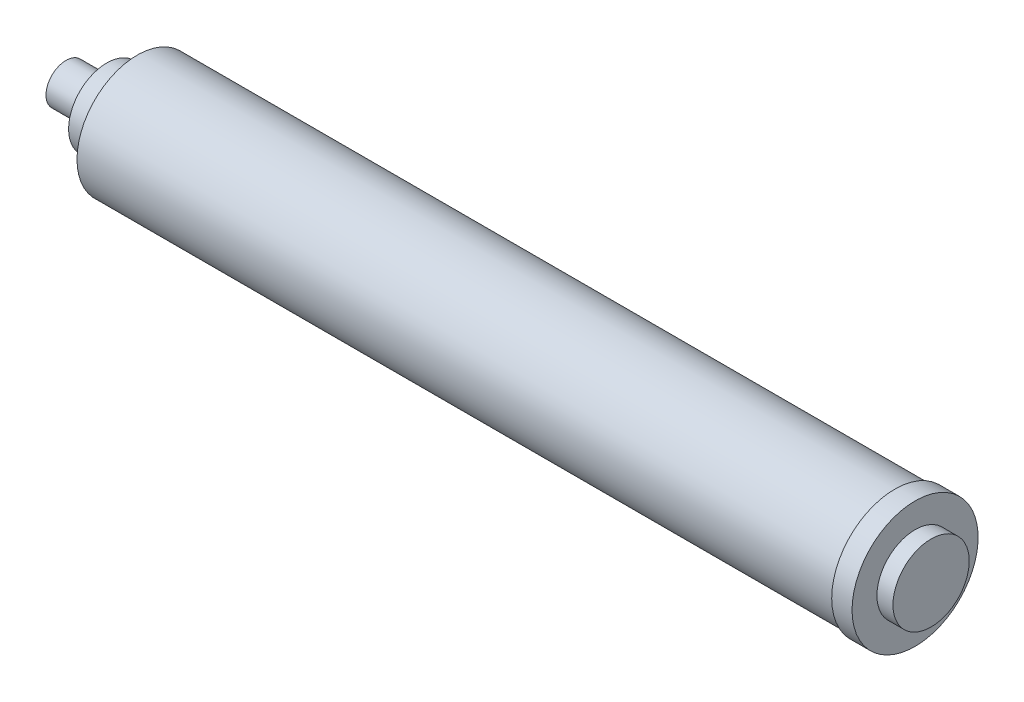
ISO-10303-21;
HEADER;
FILE_DESCRIPTION(('STEP AP214'),'2;1');
FILE_NAME('part.step','',(''),(''),'','','');
FILE_SCHEMA(('AUTOMOTIVE_DESIGN { 1 0 10303 214 1 1 1 1 }'));
ENDSEC;
DATA;
#1=APPLICATION_CONTEXT('core data for automotive mechanical design processes');
#2=APPLICATION_PROTOCOL_DEFINITION('international standard','automotive_design',2000,#1);
#3=PRODUCT_CONTEXT('',#1,'mechanical');
#4=PRODUCT('Part','Part','',(#3));
#5=PRODUCT_RELATED_PRODUCT_CATEGORY('part','',(#4));
#6=PRODUCT_DEFINITION_FORMATION('','',#4);
#7=PRODUCT_DEFINITION_CONTEXT('part definition',#1,'design');
#8=PRODUCT_DEFINITION('design','',#6,#7);
#9=PRODUCT_DEFINITION_SHAPE('','',#8);
#10=(LENGTH_UNIT() NAMED_UNIT(*) SI_UNIT(.MILLI.,.METRE.));
#11=(NAMED_UNIT(*) PLANE_ANGLE_UNIT() SI_UNIT($,.RADIAN.));
#12=(NAMED_UNIT(*) SI_UNIT($,.STERADIAN.) SOLID_ANGLE_UNIT());
#13=UNCERTAINTY_MEASURE_WITH_UNIT(LENGTH_MEASURE(1.E-05),#10,'distance_accuracy_value','');
#14=(GEOMETRIC_REPRESENTATION_CONTEXT(3) GLOBAL_UNCERTAINTY_ASSIGNED_CONTEXT((#13)) GLOBAL_UNIT_ASSIGNED_CONTEXT((#10,
#11,#12)) REPRESENTATION_CONTEXT('',''));
#15=CARTESIAN_POINT('',(0.,0.,0.));
#16=DIRECTION('',(0.,0.,1.));
#17=DIRECTION('',(1.,0.,0.));
#18=AXIS2_PLACEMENT_3D('',#15,#16,#17);
#19=CARTESIAN_POINT('',(0.,0.,0.));
#20=DIRECTION('',(-1.,0.,0.));
#21=DIRECTION('',(0.,0.,1.));
#22=AXIS2_PLACEMENT_3D('',#19,#20,#21);
#23=PLANE('',#22);
#24=CARTESIAN_POINT('',(0.,0.,0.));
#25=DIRECTION('',(-1.,0.,0.));
#26=DIRECTION('',(0.,0.,1.));
#27=AXIS2_PLACEMENT_3D('',#24,#25,#26);
#28=CIRCLE('',#27,23.8);
#29=CARTESIAN_POINT('',(0.,0.,23.8));
#30=VERTEX_POINT('',#29);
#31=EDGE_CURVE('E10',#30,#30,#28,.F.);
#32=ORIENTED_EDGE('',*,*,#31,.F.);
#33=EDGE_LOOP('',(#32));
#34=FACE_BOUND('',#33,.T.);
#35=CARTESIAN_POINT('',(0.,0.,0.));
#36=DIRECTION('',(-1.,0.,0.));
#37=DIRECTION('',(0.,0.,1.));
#38=AXIS2_PLACEMENT_3D('',#35,#36,#37);
#39=CIRCLE('',#38,39.35);
#40=CARTESIAN_POINT('',(0.,0.,39.35));
#41=VERTEX_POINT('',#40);
#42=EDGE_CURVE('E40',#41,#41,#39,.T.);
#43=ORIENTED_EDGE('',*,*,#42,.F.);
#44=EDGE_LOOP('',(#43));
#45=FACE_BOUND('',#44,.T.);
#46=ADVANCED_FACE('F30',(#34,#45),#23,.F.);
#47=CARTESIAN_POINT('',(-619.271971496437,0.,0.));
#48=DIRECTION('',(-1.,0.,0.));
#49=DIRECTION('',(0.,0.,1.));
#50=AXIS2_PLACEMENT_3D('',#47,#48,#49);
#51=CYLINDRICAL_SURFACE('',#50,39.35);
#52=CARTESIAN_POINT('',(-12.7,0.,0.));
#53=DIRECTION('',(-1.,0.,0.));
#54=DIRECTION('',(0.,0.,1.));
#55=AXIS2_PLACEMENT_3D('',#52,#53,#54);
#56=CIRCLE('',#55,39.35);
#57=CARTESIAN_POINT('',(-12.7,0.,39.35));
#58=VERTEX_POINT('',#57);
#59=EDGE_CURVE('E44',#58,#58,#56,.T.);
#60=ORIENTED_EDGE('',*,*,#59,.F.);
#61=EDGE_LOOP('',(#60));
#62=FACE_BOUND('',#61,.T.);
#63=ORIENTED_EDGE('',*,*,#42,.T.);
#64=EDGE_LOOP('',(#63));
#65=FACE_BOUND('',#64,.T.);
#66=ADVANCED_FACE('F83',(#62,#65),#51,.T.);
#67=CARTESIAN_POINT('',(-12.7,39.35,0.));
#68=DIRECTION('',(1.,0.,0.));
#69=DIRECTION('',(0.,0.,-1.));
#70=AXIS2_PLACEMENT_3D('',#67,#68,#69);
#71=PLANE('',#70);
#72=CARTESIAN_POINT('',(-12.7,0.,0.));
#73=DIRECTION('',(-1.,0.,0.));
#74=DIRECTION('',(0.,0.,1.));
#75=AXIS2_PLACEMENT_3D('',#72,#73,#74);
#76=CIRCLE('',#75,37.65);
#77=CARTESIAN_POINT('',(-12.7,0.,37.65));
#78=VERTEX_POINT('',#77);
#79=EDGE_CURVE('E49',#78,#78,#76,.T.);
#80=ORIENTED_EDGE('',*,*,#79,.F.);
#81=EDGE_LOOP('',(#80));
#82=FACE_BOUND('',#81,.T.);
#83=ORIENTED_EDGE('',*,*,#59,.T.);
#84=EDGE_LOOP('',(#83));
#85=FACE_BOUND('',#84,.T.);
#86=ADVANCED_FACE('F88',(#82,#85),#71,.F.);
#87=CARTESIAN_POINT('',(-619.271971496437,0.,0.));
#88=DIRECTION('',(-1.,0.,0.));
#89=DIRECTION('',(0.,0.,1.));
#90=AXIS2_PLACEMENT_3D('',#87,#88,#89);
#91=CYLINDRICAL_SURFACE('',#90,37.65);
#92=CARTESIAN_POINT('',(-485.5,0.,0.));
#93=DIRECTION('',(-1.,0.,0.));
#94=DIRECTION('',(0.,0.,1.));
#95=AXIS2_PLACEMENT_3D('',#92,#93,#94);
#96=CIRCLE('',#95,37.6499999999999);
#97=CARTESIAN_POINT('',(-485.5,0.,37.6499999999999));
#98=VERTEX_POINT('',#97);
#99=EDGE_CURVE('E52',#98,#98,#96,.T.);
#100=ORIENTED_EDGE('',*,*,#99,.F.);
#101=EDGE_LOOP('',(#100));
#102=FACE_BOUND('',#101,.T.);
#103=ORIENTED_EDGE('',*,*,#79,.T.);
#104=EDGE_LOOP('',(#103));
#105=FACE_BOUND('',#104,.T.);
#106=ADVANCED_FACE('F96',(#102,#105),#91,.T.);
#107=CARTESIAN_POINT('',(-485.5,37.6499999999999,0.));
#108=DIRECTION('',(1.,0.,0.));
#109=DIRECTION('',(0.,0.,-1.));
#110=AXIS2_PLACEMENT_3D('',#107,#108,#109);
#111=PLANE('',#110);
#112=CARTESIAN_POINT('',(-485.5,0.,0.));
#113=DIRECTION('',(1.,0.,0.));
#114=DIRECTION('',(0.,0.,-1.));
#115=AXIS2_PLACEMENT_3D('',#112,#113,#114);
#116=CIRCLE('',#115,23.8);
#117=CARTESIAN_POINT('',(-485.5,0.,-23.8));
#118=VERTEX_POINT('',#117);
#119=EDGE_CURVE('E36',#118,#118,#116,.F.);
#120=ORIENTED_EDGE('',*,*,#119,.F.);
#121=EDGE_LOOP('',(#120));
#122=FACE_BOUND('',#121,.T.);
#123=ORIENTED_EDGE('',*,*,#99,.T.);
#124=EDGE_LOOP('',(#123));
#125=FACE_BOUND('',#124,.T.);
#126=ADVANCED_FACE('F103',(#122,#125),#111,.F.);
#127=CARTESIAN_POINT('',(-504.6,0.,0.));
#128=DIRECTION('',(1.,0.,0.));
#129=DIRECTION('',(0.,0.,-1.));
#130=AXIS2_PLACEMENT_3D('',#127,#128,#129);
#131=CYLINDRICAL_SURFACE('',#130,23.8);
#132=CARTESIAN_POINT('',(-504.6,0.,0.));
#133=DIRECTION('',(-1.,0.,0.));
#134=DIRECTION('',(0.,0.,1.));
#135=AXIS2_PLACEMENT_3D('',#132,#133,#134);
#136=CIRCLE('',#135,23.8);
#137=CARTESIAN_POINT('',(-504.6,0.,23.8));
#138=VERTEX_POINT('',#137);
#139=EDGE_CURVE('E55',#138,#138,#136,.T.);
#140=ORIENTED_EDGE('',*,*,#139,.F.);
#141=EDGE_LOOP('',(#140));
#142=FACE_BOUND('',#141,.T.);
#143=ORIENTED_EDGE('',*,*,#119,.T.);
#144=EDGE_LOOP('',(#143));
#145=FACE_BOUND('',#144,.T.);
#146=ADVANCED_FACE('F107',(#142,#145),#131,.T.);
#147=CARTESIAN_POINT('',(-504.6,0.,0.));
#148=DIRECTION('',(-1.,0.,0.));
#149=DIRECTION('',(0.,0.,1.));
#150=AXIS2_PLACEMENT_3D('',#147,#148,#149);
#151=PLANE('',#150);
#152=CARTESIAN_POINT('',(-504.6,0.,0.));
#153=DIRECTION('',(-1.,0.,0.));
#154=DIRECTION('',(0.,0.,1.));
#155=AXIS2_PLACEMENT_3D('',#152,#153,#154);
#156=CIRCLE('',#155,12.5);
#157=CARTESIAN_POINT('',(-504.6,0.,12.5));
#158=VERTEX_POINT('',#157);
#159=EDGE_CURVE('E59',#158,#158,#156,.T.);
#160=ORIENTED_EDGE('',*,*,#159,.F.);
#161=EDGE_LOOP('',(#160));
#162=FACE_BOUND('',#161,.T.);
#163=ORIENTED_EDGE('',*,*,#139,.T.);
#164=EDGE_LOOP('',(#163));
#165=FACE_BOUND('',#164,.T.);
#166=ADVANCED_FACE('F111',(#162,#165),#151,.T.);
#167=CARTESIAN_POINT('',(-530.,0.,0.));
#168=DIRECTION('',(1.,0.,0.));
#169=DIRECTION('',(0.,0.,-1.));
#170=AXIS2_PLACEMENT_3D('',#167,#168,#169);
#171=CYLINDRICAL_SURFACE('',#170,12.5);
#172=CARTESIAN_POINT('',(-530.,0.,0.));
#173=DIRECTION('',(-1.,0.,0.));
#174=DIRECTION('',(0.,0.,1.));
#175=AXIS2_PLACEMENT_3D('',#172,#173,#174);
#176=CIRCLE('',#175,12.5);
#177=CARTESIAN_POINT('',(-530.,0.,12.5));
#178=VERTEX_POINT('',#177);
#179=EDGE_CURVE('E58',#178,#178,#176,.T.);
#180=ORIENTED_EDGE('',*,*,#179,.F.);
#181=EDGE_LOOP('',(#180));
#182=FACE_BOUND('',#181,.T.);
#183=ORIENTED_EDGE('',*,*,#159,.T.);
#184=EDGE_LOOP('',(#183));
#185=FACE_BOUND('',#184,.T.);
#186=ADVANCED_FACE('F79',(#182,#185),#171,.T.);
#187=CARTESIAN_POINT('',(-530.,0.,0.));
#188=DIRECTION('',(-1.,0.,0.));
#189=DIRECTION('',(0.,0.,1.));
#190=AXIS2_PLACEMENT_3D('',#187,#188,#189);
#191=PLANE('',#190);
#192=ORIENTED_EDGE('',*,*,#179,.T.);
#193=EDGE_LOOP('',(#192));
#194=FACE_BOUND('',#193,.T.);
#195=ADVANCED_FACE('F72',(#194),#191,.T.);
#196=CARTESIAN_POINT('',(10.,0.,0.));
#197=DIRECTION('',(-1.,0.,0.));
#198=DIRECTION('',(0.,0.,1.));
#199=AXIS2_PLACEMENT_3D('',#196,#197,#198);
#200=CYLINDRICAL_SURFACE('',#199,23.8);
#201=CARTESIAN_POINT('',(10.,0.,0.));
#202=DIRECTION('',(1.,0.,0.));
#203=DIRECTION('',(0.,0.,-1.));
#204=AXIS2_PLACEMENT_3D('',#201,#202,#203);
#205=CIRCLE('',#204,23.8);
#206=CARTESIAN_POINT('',(10.,0.,-23.8));
#207=VERTEX_POINT('',#206);
#208=EDGE_CURVE('E62',#207,#207,#205,.T.);
#209=ORIENTED_EDGE('',*,*,#208,.F.);
#210=EDGE_LOOP('',(#209));
#211=FACE_BOUND('',#210,.T.);
#212=ORIENTED_EDGE('',*,*,#31,.T.);
#213=EDGE_LOOP('',(#212));
#214=FACE_BOUND('',#213,.T.);
#215=ADVANCED_FACE('F70',(#211,#214),#200,.T.);
#216=CARTESIAN_POINT('',(10.,0.,0.));
#217=DIRECTION('',(1.,0.,0.));
#218=DIRECTION('',(0.,0.,-1.));
#219=AXIS2_PLACEMENT_3D('',#216,#217,#218);
#220=PLANE('',#219);
#221=ORIENTED_EDGE('',*,*,#208,.T.);
#222=EDGE_LOOP('',(#221));
#223=FACE_BOUND('',#222,.T.);
#224=ADVANCED_FACE('F68',(#223),#220,.T.);
#225=CLOSED_SHELL('',(#46,#66,#86,#106,#126,#146,#166,#186,#195,#215,#224));
#226=MANIFOLD_SOLID_BREP('B2',#225);
#227=ADVANCED_BREP_SHAPE_REPRESENTATION('',(#18,#226),#14);
#228=SHAPE_DEFINITION_REPRESENTATION(#9,#227);
ENDSEC;
END-ISO-10303-21;
